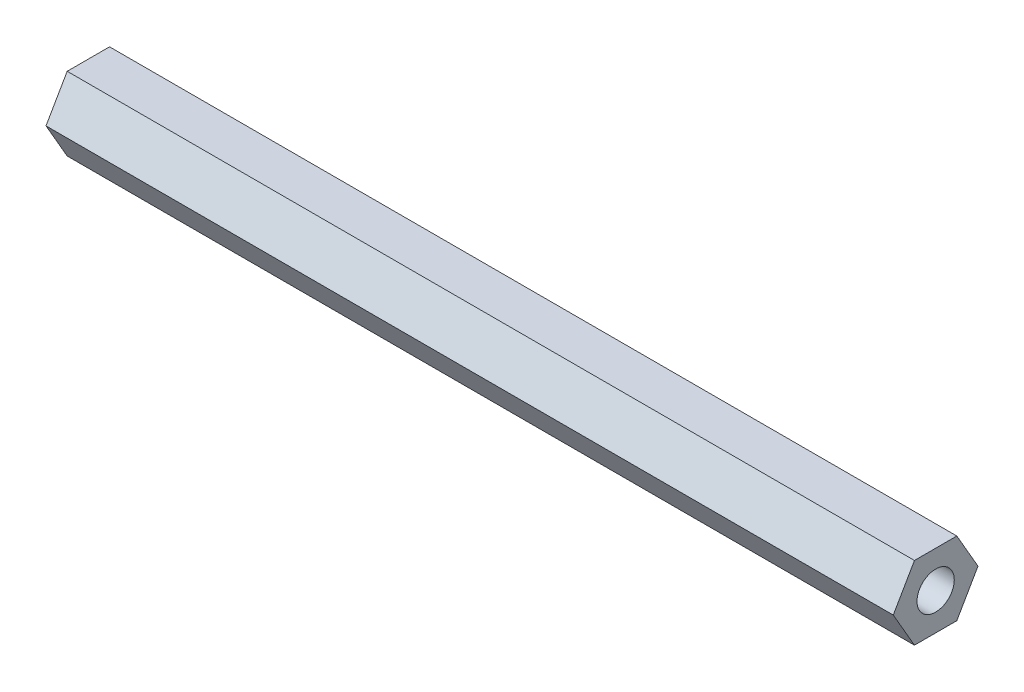
ISO-10303-21;
HEADER;
FILE_DESCRIPTION(('STEP AP214'),'2;1');
FILE_NAME('part.step','',(''),(''),'','','');
FILE_SCHEMA(('AUTOMOTIVE_DESIGN { 1 0 10303 214 1 1 1 1 }'));
ENDSEC;
DATA;
#1=APPLICATION_CONTEXT('core data for automotive mechanical design processes');
#2=APPLICATION_PROTOCOL_DEFINITION('international standard','automotive_design',2000,#1);
#3=PRODUCT_CONTEXT('',#1,'mechanical');
#4=PRODUCT('Part','Part','',(#3));
#5=PRODUCT_RELATED_PRODUCT_CATEGORY('part','',(#4));
#6=PRODUCT_DEFINITION_FORMATION('','',#4);
#7=PRODUCT_DEFINITION_CONTEXT('part definition',#1,'design');
#8=PRODUCT_DEFINITION('design','',#6,#7);
#9=PRODUCT_DEFINITION_SHAPE('','',#8);
#10=(LENGTH_UNIT() NAMED_UNIT(*) SI_UNIT(.MILLI.,.METRE.));
#11=(NAMED_UNIT(*) PLANE_ANGLE_UNIT() SI_UNIT($,.RADIAN.));
#12=(NAMED_UNIT(*) SI_UNIT($,.STERADIAN.) SOLID_ANGLE_UNIT());
#13=UNCERTAINTY_MEASURE_WITH_UNIT(LENGTH_MEASURE(1.E-05),#10,'distance_accuracy_value','');
#14=(GEOMETRIC_REPRESENTATION_CONTEXT(3) GLOBAL_UNCERTAINTY_ASSIGNED_CONTEXT((#13)) GLOBAL_UNIT_ASSIGNED_CONTEXT((#10,
#11,#12)) REPRESENTATION_CONTEXT('',''));
#15=CARTESIAN_POINT('',(0.,0.,0.));
#16=DIRECTION('',(0.,0.,1.));
#17=DIRECTION('',(1.,0.,0.));
#18=AXIS2_PLACEMENT_3D('',#15,#16,#17);
#19=CARTESIAN_POINT('',(50.,0.,0.));
#20=DIRECTION('',(1.,0.,0.));
#21=DIRECTION('',(0.,0.,-1.));
#22=AXIS2_PLACEMENT_3D('',#19,#20,#21);
#23=PLANE('',#22);
#24=DIRECTION('',(0.,0.866025403784438,0.5));
#25=VECTOR('',#24,1.);
#26=CARTESIAN_POINT('',(50.,0.,-2.5));
#27=LINE('',#26,#25);
#28=CARTESIAN_POINT('',(50.,0.,-2.5));
#29=VERTEX_POINT('',#28);
#30=CARTESIAN_POINT('',(50.,2.1650635094611,-1.25));
#31=VERTEX_POINT('',#30);
#32=EDGE_CURVE('E152',#29,#31,#27,.T.);
#33=ORIENTED_EDGE('',*,*,#32,.T.);
#34=DIRECTION('',(0.,0.,1.));
#35=VECTOR('',#34,1.);
#36=CARTESIAN_POINT('',(50.,2.1650635094611,-1.25));
#37=LINE('',#36,#35);
#38=CARTESIAN_POINT('',(50.,2.1650635094611,1.25));
#39=VERTEX_POINT('',#38);
#40=EDGE_CURVE('E100',#31,#39,#37,.T.);
#41=ORIENTED_EDGE('',*,*,#40,.T.);
#42=DIRECTION('',(0.,-0.866025403784439,0.5));
#43=VECTOR('',#42,1.);
#44=CARTESIAN_POINT('',(50.,2.1650635094611,1.25));
#45=LINE('',#44,#43);
#46=CARTESIAN_POINT('',(50.,0.,2.5));
#47=VERTEX_POINT('',#46);
#48=EDGE_CURVE('E113',#39,#47,#45,.T.);
#49=ORIENTED_EDGE('',*,*,#48,.T.);
#50=DIRECTION('',(0.,-0.866025403784439,-0.5));
#51=VECTOR('',#50,1.);
#52=CARTESIAN_POINT('',(50.,0.,2.5));
#53=LINE('',#52,#51);
#54=CARTESIAN_POINT('',(50.,-2.1650635094611,1.25));
#55=VERTEX_POINT('',#54);
#56=EDGE_CURVE('E107',#47,#55,#53,.T.);
#57=ORIENTED_EDGE('',*,*,#56,.T.);
#58=DIRECTION('',(0.,0.,-1.));
#59=VECTOR('',#58,1.);
#60=CARTESIAN_POINT('',(50.,-2.1650635094611,1.25));
#61=LINE('',#60,#59);
#62=CARTESIAN_POINT('',(50.,-2.1650635094611,-1.25));
#63=VERTEX_POINT('',#62);
#64=EDGE_CURVE('E111',#55,#63,#61,.T.);
#65=ORIENTED_EDGE('',*,*,#64,.T.);
#66=DIRECTION('',(0.,0.866025403784439,-0.5));
#67=VECTOR('',#66,1.);
#68=CARTESIAN_POINT('',(50.,-2.1650635094611,-1.25));
#69=LINE('',#68,#67);
#70=EDGE_CURVE('E63',#63,#29,#69,.T.);
#71=ORIENTED_EDGE('',*,*,#70,.T.);
#72=EDGE_LOOP('',(#33,#41,#49,#57,#65,#71));
#73=FACE_BOUND('',#72,.T.);
#74=CARTESIAN_POINT('',(50.,0.,0.));
#75=DIRECTION('',(1.,0.,0.));
#76=DIRECTION('',(0.,0.,-1.));
#77=AXIS2_PLACEMENT_3D('',#74,#75,#76);
#78=CIRCLE('',#77,1.1);
#79=CARTESIAN_POINT('',(50.,0.,-1.1));
#80=VERTEX_POINT('',#79);
#81=EDGE_CURVE('E140',#80,#80,#78,.T.);
#82=ORIENTED_EDGE('',*,*,#81,.F.);
#83=EDGE_LOOP('',(#82));
#84=FACE_BOUND('',#83,.T.);
#85=ADVANCED_FACE('F45',(#73,#84),#23,.T.);
#86=CARTESIAN_POINT('',(0.,0.,0.));
#87=DIRECTION('',(1.,0.,0.));
#88=DIRECTION('',(0.,0.,-1.));
#89=AXIS2_PLACEMENT_3D('',#86,#87,#88);
#90=PLANE('',#89);
#91=DIRECTION('',(0.,0.866025403784438,0.5));
#92=VECTOR('',#91,1.);
#93=CARTESIAN_POINT('',(0.,0.,-2.5));
#94=LINE('',#93,#92);
#95=CARTESIAN_POINT('',(0.,0.,-2.5));
#96=VERTEX_POINT('',#95);
#97=CARTESIAN_POINT('',(0.,2.1650635094611,-1.25));
#98=VERTEX_POINT('',#97);
#99=EDGE_CURVE('E135',#96,#98,#94,.T.);
#100=ORIENTED_EDGE('',*,*,#99,.F.);
#101=DIRECTION('',(0.,0.866025403784439,-0.5));
#102=VECTOR('',#101,1.);
#103=CARTESIAN_POINT('',(0.,-2.1650635094611,-1.25));
#104=LINE('',#103,#102);
#105=CARTESIAN_POINT('',(0.,-2.1650635094611,-1.25));
#106=VERTEX_POINT('',#105);
#107=EDGE_CURVE('E92',#106,#96,#104,.T.);
#108=ORIENTED_EDGE('',*,*,#107,.F.);
#109=DIRECTION('',(0.,0.,-1.));
#110=VECTOR('',#109,1.);
#111=CARTESIAN_POINT('',(0.,-2.1650635094611,1.25));
#112=LINE('',#111,#110);
#113=CARTESIAN_POINT('',(0.,-2.1650635094611,1.25));
#114=VERTEX_POINT('',#113);
#115=EDGE_CURVE('E86',#114,#106,#112,.T.);
#116=ORIENTED_EDGE('',*,*,#115,.F.);
#117=DIRECTION('',(0.,-0.866025403784439,-0.5));
#118=VECTOR('',#117,1.);
#119=CARTESIAN_POINT('',(0.,0.,2.5));
#120=LINE('',#119,#118);
#121=CARTESIAN_POINT('',(0.,0.,2.5));
#122=VERTEX_POINT('',#121);
#123=EDGE_CURVE('E122',#122,#114,#120,.T.);
#124=ORIENTED_EDGE('',*,*,#123,.F.);
#125=DIRECTION('',(0.,-0.866025403784439,0.5));
#126=VECTOR('',#125,1.);
#127=CARTESIAN_POINT('',(0.,2.1650635094611,1.25));
#128=LINE('',#127,#126);
#129=CARTESIAN_POINT('',(0.,2.1650635094611,1.25));
#130=VERTEX_POINT('',#129);
#131=EDGE_CURVE('E143',#130,#122,#128,.T.);
#132=ORIENTED_EDGE('',*,*,#131,.F.);
#133=DIRECTION('',(0.,0.,1.));
#134=VECTOR('',#133,1.);
#135=CARTESIAN_POINT('',(0.,2.1650635094611,-1.25));
#136=LINE('',#135,#134);
#137=EDGE_CURVE('E139',#98,#130,#136,.T.);
#138=ORIENTED_EDGE('',*,*,#137,.F.);
#139=EDGE_LOOP('',(#100,#108,#116,#124,#132,#138));
#140=FACE_BOUND('',#139,.T.);
#141=CARTESIAN_POINT('',(0.,0.,0.));
#142=DIRECTION('',(1.,0.,0.));
#143=DIRECTION('',(0.,0.,-1.));
#144=AXIS2_PLACEMENT_3D('',#141,#142,#143);
#145=CIRCLE('',#144,1.1);
#146=CARTESIAN_POINT('',(0.,0.,-1.1));
#147=VERTEX_POINT('',#146);
#148=EDGE_CURVE('E249',#147,#147,#145,.T.);
#149=ORIENTED_EDGE('',*,*,#148,.T.);
#150=EDGE_LOOP('',(#149));
#151=FACE_BOUND('',#150,.T.);
#152=ADVANCED_FACE('F165',(#140,#151),#90,.F.);
#153=CARTESIAN_POINT('',(50.,0.,-2.5));
#154=DIRECTION('',(0.,-0.5,0.866025403784438));
#155=DIRECTION('',(0.,-0.866025403784438,-0.5));
#156=AXIS2_PLACEMENT_3D('',#153,#154,#155);
#157=PLANE('',#156);
#158=ORIENTED_EDGE('',*,*,#99,.T.);
#159=DIRECTION('',(-1.,0.,0.));
#160=VECTOR('',#159,1.);
#161=CARTESIAN_POINT('',(50.,2.1650635094611,-1.25));
#162=LINE('',#161,#160);
#163=EDGE_CURVE('E11',#31,#98,#162,.T.);
#164=ORIENTED_EDGE('',*,*,#163,.F.);
#165=ORIENTED_EDGE('',*,*,#32,.F.);
#166=DIRECTION('',(-1.,0.,0.));
#167=VECTOR('',#166,1.);
#168=CARTESIAN_POINT('',(50.,0.,-2.5));
#169=LINE('',#168,#167);
#170=EDGE_CURVE('E131',#29,#96,#169,.T.);
#171=ORIENTED_EDGE('',*,*,#170,.T.);
#172=EDGE_LOOP('',(#158,#164,#165,#171));
#173=FACE_BOUND('',#172,.T.);
#174=ADVANCED_FACE('F47',(#173),#157,.F.);
#175=CARTESIAN_POINT('',(50.,2.1650635094611,-1.25));
#176=DIRECTION('',(0.,-1.,0.));
#177=DIRECTION('',(0.,0.,-1.));
#178=AXIS2_PLACEMENT_3D('',#175,#176,#177);
#179=PLANE('',#178);
#180=ORIENTED_EDGE('',*,*,#137,.T.);
#181=DIRECTION('',(-1.,0.,0.));
#182=VECTOR('',#181,1.);
#183=CARTESIAN_POINT('',(50.,2.1650635094611,1.25));
#184=LINE('',#183,#182);
#185=EDGE_CURVE('E55',#39,#130,#184,.T.);
#186=ORIENTED_EDGE('',*,*,#185,.F.);
#187=ORIENTED_EDGE('',*,*,#40,.F.);
#188=ORIENTED_EDGE('',*,*,#163,.T.);
#189=EDGE_LOOP('',(#180,#186,#187,#188));
#190=FACE_BOUND('',#189,.T.);
#191=ADVANCED_FACE('F190',(#190),#179,.F.);
#192=CARTESIAN_POINT('',(50.,2.1650635094611,1.25));
#193=DIRECTION('',(0.,-0.5,-0.866025403784439));
#194=DIRECTION('',(0.,0.866025403784439,-0.5));
#195=AXIS2_PLACEMENT_3D('',#192,#193,#194);
#196=PLANE('',#195);
#197=ORIENTED_EDGE('',*,*,#131,.T.);
#198=DIRECTION('',(-1.,0.,0.));
#199=VECTOR('',#198,1.);
#200=CARTESIAN_POINT('',(50.,0.,2.5));
#201=LINE('',#200,#199);
#202=EDGE_CURVE('E124',#47,#122,#201,.T.);
#203=ORIENTED_EDGE('',*,*,#202,.F.);
#204=ORIENTED_EDGE('',*,*,#48,.F.);
#205=ORIENTED_EDGE('',*,*,#185,.T.);
#206=EDGE_LOOP('',(#197,#203,#204,#205));
#207=FACE_BOUND('',#206,.T.);
#208=ADVANCED_FACE('F162',(#207),#196,.F.);
#209=CARTESIAN_POINT('',(50.,0.,2.5));
#210=DIRECTION('',(0.,0.5,-0.866025403784439));
#211=DIRECTION('',(0.,0.866025403784439,0.5));
#212=AXIS2_PLACEMENT_3D('',#209,#210,#211);
#213=PLANE('',#212);
#214=ORIENTED_EDGE('',*,*,#123,.T.);
#215=DIRECTION('',(-1.,0.,0.));
#216=VECTOR('',#215,1.);
#217=CARTESIAN_POINT('',(50.,-2.1650635094611,1.25));
#218=LINE('',#217,#216);
#219=EDGE_CURVE('E119',#55,#114,#218,.T.);
#220=ORIENTED_EDGE('',*,*,#219,.F.);
#221=ORIENTED_EDGE('',*,*,#56,.F.);
#222=ORIENTED_EDGE('',*,*,#202,.T.);
#223=EDGE_LOOP('',(#214,#220,#221,#222));
#224=FACE_BOUND('',#223,.T.);
#225=ADVANCED_FACE('F120',(#224),#213,.F.);
#226=CARTESIAN_POINT('',(50.,-2.1650635094611,1.25));
#227=DIRECTION('',(0.,1.,0.));
#228=DIRECTION('',(0.,0.,1.));
#229=AXIS2_PLACEMENT_3D('',#226,#227,#228);
#230=PLANE('',#229);
#231=ORIENTED_EDGE('',*,*,#115,.T.);
#232=DIRECTION('',(-1.,0.,0.));
#233=VECTOR('',#232,1.);
#234=CARTESIAN_POINT('',(50.,-2.1650635094611,-1.25));
#235=LINE('',#234,#233);
#236=EDGE_CURVE('E125',#63,#106,#235,.T.);
#237=ORIENTED_EDGE('',*,*,#236,.F.);
#238=ORIENTED_EDGE('',*,*,#64,.F.);
#239=ORIENTED_EDGE('',*,*,#219,.T.);
#240=EDGE_LOOP('',(#231,#237,#238,#239));
#241=FACE_BOUND('',#240,.T.);
#242=ADVANCED_FACE('F127',(#241),#230,.F.);
#243=CARTESIAN_POINT('',(50.,-2.1650635094611,-1.25));
#244=DIRECTION('',(0.,0.5,0.866025403784439));
#245=DIRECTION('',(0.,-0.866025403784439,0.5));
#246=AXIS2_PLACEMENT_3D('',#243,#244,#245);
#247=PLANE('',#246);
#248=ORIENTED_EDGE('',*,*,#107,.T.);
#249=ORIENTED_EDGE('',*,*,#170,.F.);
#250=ORIENTED_EDGE('',*,*,#70,.F.);
#251=ORIENTED_EDGE('',*,*,#236,.T.);
#252=EDGE_LOOP('',(#248,#249,#250,#251));
#253=FACE_BOUND('',#252,.T.);
#254=ADVANCED_FACE('F170',(#253),#247,.F.);
#255=CARTESIAN_POINT('',(50.,0.,0.));
#256=DIRECTION('',(-1.,0.,0.));
#257=DIRECTION('',(0.,0.,1.));
#258=AXIS2_PLACEMENT_3D('',#255,#256,#257);
#259=CYLINDRICAL_SURFACE('',#258,1.1);
#260=ORIENTED_EDGE('',*,*,#81,.T.);
#261=EDGE_LOOP('',(#260));
#262=FACE_BOUND('',#261,.T.);
#263=ORIENTED_EDGE('',*,*,#148,.F.);
#264=EDGE_LOOP('',(#263));
#265=FACE_BOUND('',#264,.T.);
#266=ADVANCED_FACE('F172',(#262,#265),#259,.F.);
#267=CLOSED_SHELL('',(#85,#152,#174,#191,#208,#225,#242,#254,#266));
#268=MANIFOLD_SOLID_BREP('B2',#267);
#269=ADVANCED_BREP_SHAPE_REPRESENTATION('',(#18,#268),#14);
#270=SHAPE_DEFINITION_REPRESENTATION(#9,#269);
ENDSEC;
END-ISO-10303-21;
